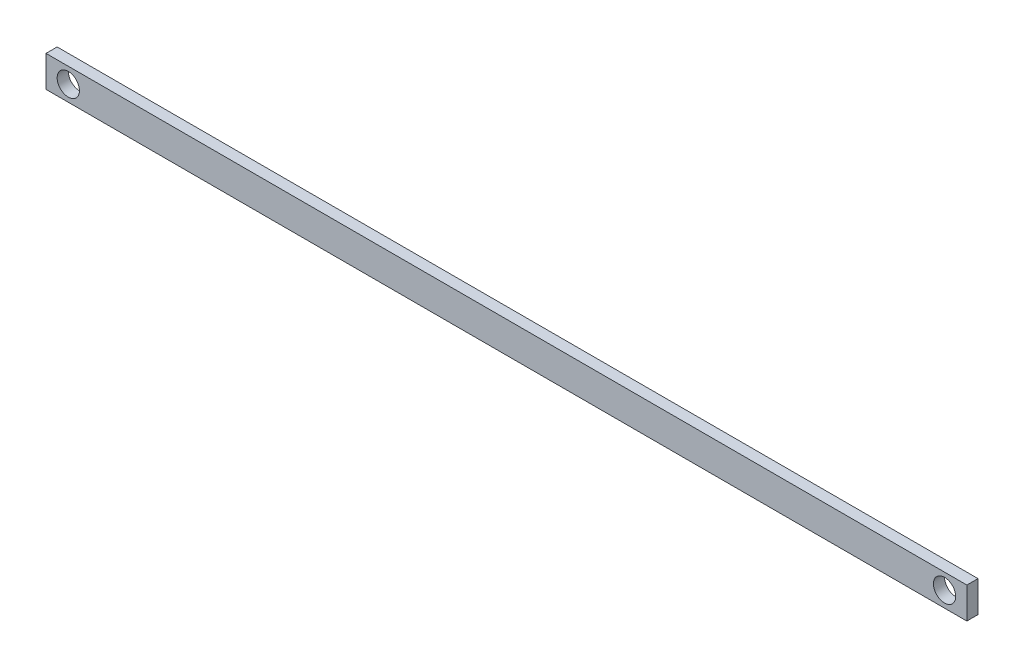
ISO-10303-21;
HEADER;
FILE_DESCRIPTION(('STEP AP214'),'2;1');
FILE_NAME('part.step','',(''),(''),'','','');
FILE_SCHEMA(('AUTOMOTIVE_DESIGN { 1 0 10303 214 1 1 1 1 }'));
ENDSEC;
DATA;
#1=APPLICATION_CONTEXT('core data for automotive mechanical design processes');
#2=APPLICATION_PROTOCOL_DEFINITION('international standard','automotive_design',2000,#1);
#3=PRODUCT_CONTEXT('',#1,'mechanical');
#4=PRODUCT('Part','Part','',(#3));
#5=PRODUCT_RELATED_PRODUCT_CATEGORY('part','',(#4));
#6=PRODUCT_DEFINITION_FORMATION('','',#4);
#7=PRODUCT_DEFINITION_CONTEXT('part definition',#1,'design');
#8=PRODUCT_DEFINITION('design','',#6,#7);
#9=PRODUCT_DEFINITION_SHAPE('','',#8);
#10=(LENGTH_UNIT() NAMED_UNIT(*) SI_UNIT(.MILLI.,.METRE.));
#11=(NAMED_UNIT(*) PLANE_ANGLE_UNIT() SI_UNIT($,.RADIAN.));
#12=(NAMED_UNIT(*) SI_UNIT($,.STERADIAN.) SOLID_ANGLE_UNIT());
#13=UNCERTAINTY_MEASURE_WITH_UNIT(LENGTH_MEASURE(1.E-05),#10,'distance_accuracy_value','');
#14=(GEOMETRIC_REPRESENTATION_CONTEXT(3) GLOBAL_UNCERTAINTY_ASSIGNED_CONTEXT((#13)) GLOBAL_UNIT_ASSIGNED_CONTEXT((#10,
#11,#12)) REPRESENTATION_CONTEXT('',''));
#15=CARTESIAN_POINT('',(0.,0.,0.));
#16=DIRECTION('',(0.,0.,1.));
#17=DIRECTION('',(1.,0.,0.));
#18=AXIS2_PLACEMENT_3D('',#15,#16,#17);
#19=CARTESIAN_POINT('',(3930.,0.,50.));
#20=DIRECTION('',(0.,1.,0.));
#21=DIRECTION('',(-1.,0.,0.));
#22=AXIS2_PLACEMENT_3D('',#19,#20,#21);
#23=PLANE('',#22);
#24=DIRECTION('',(1.,0.,0.));
#25=VECTOR('',#24,1.);
#26=CARTESIAN_POINT('',(3930.,0.,0.));
#27=LINE('',#26,#25);
#28=CARTESIAN_POINT('',(-100.,0.,0.));
#29=VERTEX_POINT('',#28);
#30=CARTESIAN_POINT('',(4030.,0.,0.));
#31=VERTEX_POINT('',#30);
#32=EDGE_CURVE('E82',#29,#31,#27,.T.);
#33=ORIENTED_EDGE('',*,*,#32,.T.);
#34=DIRECTION('',(0.,0.,-1.));
#35=VECTOR('',#34,1.);
#36=CARTESIAN_POINT('',(4030.,0.,50.));
#37=LINE('',#36,#35);
#38=CARTESIAN_POINT('',(4030.,0.,50.));
#39=VERTEX_POINT('',#38);
#40=EDGE_CURVE('E102',#39,#31,#37,.T.);
#41=ORIENTED_EDGE('',*,*,#40,.F.);
#42=DIRECTION('',(1.,0.,0.));
#43=VECTOR('',#42,1.);
#44=CARTESIAN_POINT('',(3930.,0.,50.));
#45=LINE('',#44,#43);
#46=CARTESIAN_POINT('',(-100.,0.,50.));
#47=VERTEX_POINT('',#46);
#48=EDGE_CURVE('E50',#47,#39,#45,.T.);
#49=ORIENTED_EDGE('',*,*,#48,.F.);
#50=DIRECTION('',(0.,0.,-1.));
#51=VECTOR('',#50,1.);
#52=CARTESIAN_POINT('',(-100.,0.,50.));
#53=LINE('',#52,#51);
#54=EDGE_CURVE('E90',#47,#29,#53,.T.);
#55=ORIENTED_EDGE('',*,*,#54,.T.);
#56=EDGE_LOOP('',(#33,#41,#49,#55));
#57=FACE_BOUND('',#56,.T.);
#58=ADVANCED_FACE('F34',(#57),#23,.F.);
#59=CARTESIAN_POINT('',(0.,140.,50.));
#60=DIRECTION('',(0.,-1.,0.));
#61=DIRECTION('',(0.,0.,-1.));
#62=AXIS2_PLACEMENT_3D('',#59,#60,#61);
#63=PLANE('',#62);
#64=DIRECTION('',(-1.,0.,0.));
#65=VECTOR('',#64,1.);
#66=CARTESIAN_POINT('',(0.,140.,0.));
#67=LINE('',#66,#65);
#68=CARTESIAN_POINT('',(4030.,140.,0.));
#69=VERTEX_POINT('',#68);
#70=CARTESIAN_POINT('',(-100.,140.,0.));
#71=VERTEX_POINT('',#70);
#72=EDGE_CURVE('E62',#69,#71,#67,.T.);
#73=ORIENTED_EDGE('',*,*,#72,.T.);
#74=DIRECTION('',(0.,0.,-1.));
#75=VECTOR('',#74,1.);
#76=CARTESIAN_POINT('',(-100.,140.,50.));
#77=LINE('',#76,#75);
#78=CARTESIAN_POINT('',(-100.,140.,50.));
#79=VERTEX_POINT('',#78);
#80=EDGE_CURVE('E77',#79,#71,#77,.T.);
#81=ORIENTED_EDGE('',*,*,#80,.F.);
#82=DIRECTION('',(-1.,0.,0.));
#83=VECTOR('',#82,1.);
#84=CARTESIAN_POINT('',(0.,140.,50.));
#85=LINE('',#84,#83);
#86=CARTESIAN_POINT('',(4030.,140.,50.));
#87=VERTEX_POINT('',#86);
#88=EDGE_CURVE('E42',#87,#79,#85,.T.);
#89=ORIENTED_EDGE('',*,*,#88,.F.);
#90=DIRECTION('',(0.,0.,-1.));
#91=VECTOR('',#90,1.);
#92=CARTESIAN_POINT('',(4030.,140.,50.));
#93=LINE('',#92,#91);
#94=EDGE_CURVE('E80',#87,#69,#93,.T.);
#95=ORIENTED_EDGE('',*,*,#94,.T.);
#96=EDGE_LOOP('',(#73,#81,#89,#95));
#97=FACE_BOUND('',#96,.T.);
#98=ADVANCED_FACE('F76',(#97),#63,.F.);
#99=CARTESIAN_POINT('',(0.,0.,50.));
#100=DIRECTION('',(0.,0.,-1.));
#101=DIRECTION('',(-1.,0.,0.));
#102=AXIS2_PLACEMENT_3D('',#99,#100,#101);
#103=PLANE('',#102);
#104=CARTESIAN_POINT('',(0.,70.,50.));
#105=DIRECTION('',(0.,0.,1.));
#106=DIRECTION('',(1.,0.,0.));
#107=AXIS2_PLACEMENT_3D('',#104,#105,#106);
#108=CIRCLE('',#107,50.);
#109=CARTESIAN_POINT('',(50.,70.,50.));
#110=VERTEX_POINT('',#109);
#111=EDGE_CURVE('E105',#110,#110,#108,.T.);
#112=ORIENTED_EDGE('',*,*,#111,.F.);
#113=EDGE_LOOP('',(#112));
#114=FACE_BOUND('',#113,.T.);
#115=CARTESIAN_POINT('',(3930.,70.,50.));
#116=DIRECTION('',(0.,0.,1.));
#117=DIRECTION('',(1.,0.,0.));
#118=AXIS2_PLACEMENT_3D('',#115,#116,#117);
#119=CIRCLE('',#118,50.);
#120=CARTESIAN_POINT('',(3980.,70.,50.));
#121=VERTEX_POINT('',#120);
#122=EDGE_CURVE('E110',#121,#121,#119,.T.);
#123=ORIENTED_EDGE('',*,*,#122,.F.);
#124=EDGE_LOOP('',(#123));
#125=FACE_BOUND('',#124,.T.);
#126=ORIENTED_EDGE('',*,*,#48,.T.);
#127=DIRECTION('',(0.,-1.,0.));
#128=VECTOR('',#127,1.);
#129=CARTESIAN_POINT('',(4030.,140.,50.));
#130=LINE('',#129,#128);
#131=EDGE_CURVE('E98',#87,#39,#130,.T.);
#132=ORIENTED_EDGE('',*,*,#131,.F.);
#133=ORIENTED_EDGE('',*,*,#88,.T.);
#134=DIRECTION('',(0.,1.,0.));
#135=VECTOR('',#134,1.);
#136=CARTESIAN_POINT('',(-100.,140.,50.));
#137=LINE('',#136,#135);
#138=EDGE_CURVE('E88',#47,#79,#137,.T.);
#139=ORIENTED_EDGE('',*,*,#138,.F.);
#140=EDGE_LOOP('',(#126,#132,#133,#139));
#141=FACE_BOUND('',#140,.T.);
#142=ADVANCED_FACE('F120',(#114,#125,#141),#103,.F.);
#143=CARTESIAN_POINT('',(0.,0.,0.));
#144=DIRECTION('',(0.,0.,-1.));
#145=DIRECTION('',(-1.,0.,0.));
#146=AXIS2_PLACEMENT_3D('',#143,#144,#145);
#147=PLANE('',#146);
#148=CARTESIAN_POINT('',(0.,70.,0.));
#149=DIRECTION('',(0.,0.,-1.));
#150=DIRECTION('',(-1.,0.,0.));
#151=AXIS2_PLACEMENT_3D('',#148,#149,#150);
#152=CIRCLE('',#151,50.);
#153=CARTESIAN_POINT('',(-50.,70.,0.));
#154=VERTEX_POINT('',#153);
#155=EDGE_CURVE('E11',#154,#154,#152,.T.);
#156=ORIENTED_EDGE('',*,*,#155,.F.);
#157=EDGE_LOOP('',(#156));
#158=FACE_BOUND('',#157,.T.);
#159=CARTESIAN_POINT('',(3930.,70.,0.));
#160=DIRECTION('',(0.,0.,1.));
#161=DIRECTION('',(1.,0.,0.));
#162=AXIS2_PLACEMENT_3D('',#159,#160,#161);
#163=CIRCLE('',#162,50.);
#164=CARTESIAN_POINT('',(3980.,70.,0.));
#165=VERTEX_POINT('',#164);
#166=EDGE_CURVE('E107',#165,#165,#163,.T.);
#167=ORIENTED_EDGE('',*,*,#166,.T.);
#168=EDGE_LOOP('',(#167));
#169=FACE_BOUND('',#168,.T.);
#170=DIRECTION('',(0.,-1.,0.));
#171=VECTOR('',#170,1.);
#172=CARTESIAN_POINT('',(4030.,140.,0.));
#173=LINE('',#172,#171);
#174=EDGE_CURVE('E89',#69,#31,#173,.T.);
#175=ORIENTED_EDGE('',*,*,#174,.T.);
#176=ORIENTED_EDGE('',*,*,#32,.F.);
#177=DIRECTION('',(0.,1.,0.));
#178=VECTOR('',#177,1.);
#179=CARTESIAN_POINT('',(-100.,140.,0.));
#180=LINE('',#179,#178);
#181=EDGE_CURVE('E87',#29,#71,#180,.T.);
#182=ORIENTED_EDGE('',*,*,#181,.T.);
#183=ORIENTED_EDGE('',*,*,#72,.F.);
#184=EDGE_LOOP('',(#175,#176,#182,#183));
#185=FACE_BOUND('',#184,.T.);
#186=ADVANCED_FACE('F92',(#158,#169,#185),#147,.T.);
#187=CARTESIAN_POINT('',(0.,70.,0.));
#188=DIRECTION('',(0.,0.,1.));
#189=DIRECTION('',(1.,0.,0.));
#190=AXIS2_PLACEMENT_3D('',#187,#188,#189);
#191=CYLINDRICAL_SURFACE('',#190,50.);
#192=ORIENTED_EDGE('',*,*,#155,.T.);
#193=EDGE_LOOP('',(#192));
#194=FACE_BOUND('',#193,.T.);
#195=ORIENTED_EDGE('',*,*,#111,.T.);
#196=EDGE_LOOP('',(#195));
#197=FACE_BOUND('',#196,.T.);
#198=ADVANCED_FACE('F128',(#194,#197),#191,.F.);
#199=CARTESIAN_POINT('',(3930.,70.,0.));
#200=DIRECTION('',(0.,0.,1.));
#201=DIRECTION('',(1.,0.,0.));
#202=AXIS2_PLACEMENT_3D('',#199,#200,#201);
#203=CYLINDRICAL_SURFACE('',#202,50.);
#204=ORIENTED_EDGE('',*,*,#166,.F.);
#205=EDGE_LOOP('',(#204));
#206=FACE_BOUND('',#205,.T.);
#207=ORIENTED_EDGE('',*,*,#122,.T.);
#208=EDGE_LOOP('',(#207));
#209=FACE_BOUND('',#208,.T.);
#210=ADVANCED_FACE('F152',(#206,#209),#203,.F.);
#211=CARTESIAN_POINT('',(4030.,140.,50.));
#212=DIRECTION('',(1.,0.,0.));
#213=DIRECTION('',(0.,0.,-1.));
#214=AXIS2_PLACEMENT_3D('',#211,#212,#213);
#215=PLANE('',#214);
#216=ORIENTED_EDGE('',*,*,#174,.F.);
#217=ORIENTED_EDGE('',*,*,#94,.F.);
#218=ORIENTED_EDGE('',*,*,#131,.T.);
#219=ORIENTED_EDGE('',*,*,#40,.T.);
#220=EDGE_LOOP('',(#216,#217,#218,#219));
#221=FACE_BOUND('',#220,.T.);
#222=ADVANCED_FACE('F119',(#221),#215,.T.);
#223=CARTESIAN_POINT('',(-100.,140.,50.));
#224=DIRECTION('',(-1.,0.,0.));
#225=DIRECTION('',(0.,-1.,0.));
#226=AXIS2_PLACEMENT_3D('',#223,#224,#225);
#227=PLANE('',#226);
#228=ORIENTED_EDGE('',*,*,#181,.F.);
#229=ORIENTED_EDGE('',*,*,#54,.F.);
#230=ORIENTED_EDGE('',*,*,#138,.T.);
#231=ORIENTED_EDGE('',*,*,#80,.T.);
#232=EDGE_LOOP('',(#228,#229,#230,#231));
#233=FACE_BOUND('',#232,.T.);
#234=ADVANCED_FACE('F85',(#233),#227,.T.);
#235=CLOSED_SHELL('',(#58,#98,#142,#186,#198,#210,#222,#234));
#236=MANIFOLD_SOLID_BREP('B2',#235);
#237=ADVANCED_BREP_SHAPE_REPRESENTATION('',(#18,#236),#14);
#238=SHAPE_DEFINITION_REPRESENTATION(#9,#237);
ENDSEC;
END-ISO-10303-21;
